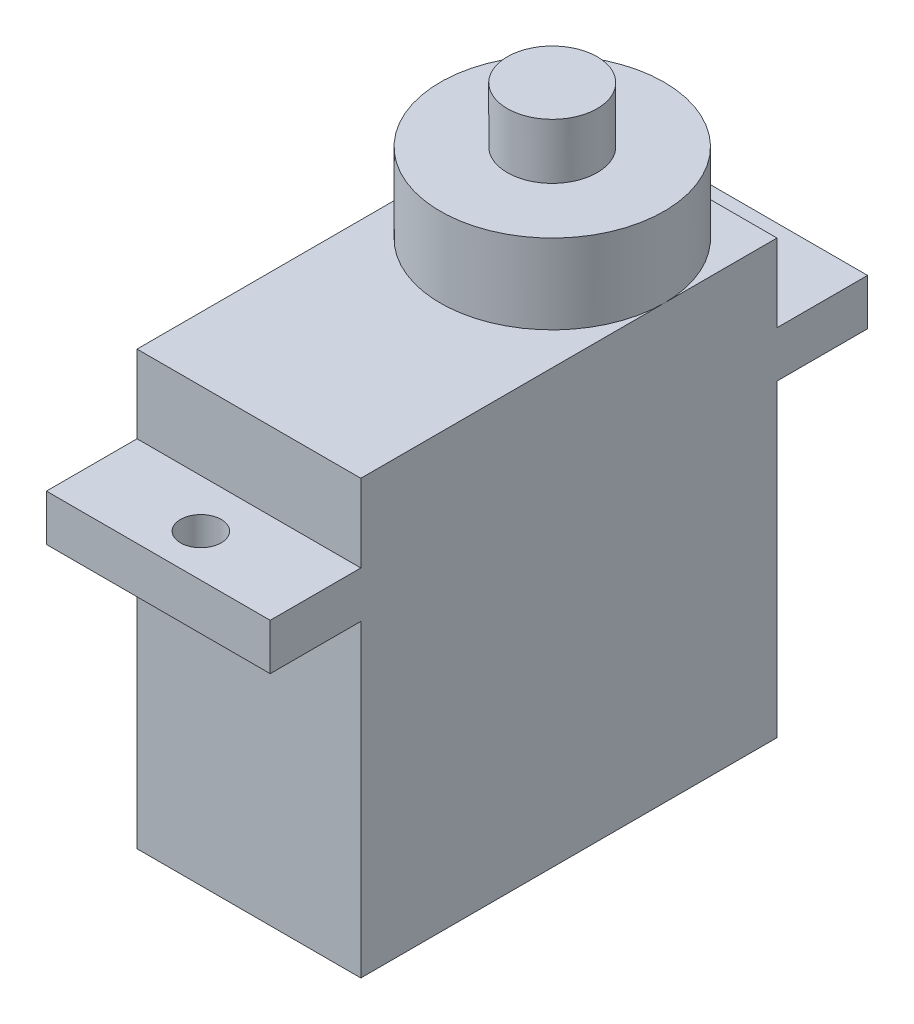
ISO-10303-21;
HEADER;
FILE_DESCRIPTION(('STEP AP214'),'2;1');
FILE_NAME('part.step','',(''),(''),'','','');
FILE_SCHEMA(('AUTOMOTIVE_DESIGN { 1 0 10303 214 1 1 1 1 }'));
ENDSEC;
DATA;
#1=APPLICATION_CONTEXT('core data for automotive mechanical design processes');
#2=APPLICATION_PROTOCOL_DEFINITION('international standard','automotive_design',2000,#1);
#3=PRODUCT_CONTEXT('',#1,'mechanical');
#4=PRODUCT('Part','Part','',(#3));
#5=PRODUCT_RELATED_PRODUCT_CATEGORY('part','',(#4));
#6=PRODUCT_DEFINITION_FORMATION('','',#4);
#7=PRODUCT_DEFINITION_CONTEXT('part definition',#1,'design');
#8=PRODUCT_DEFINITION('design','',#6,#7);
#9=PRODUCT_DEFINITION_SHAPE('','',#8);
#10=(LENGTH_UNIT() NAMED_UNIT(*) SI_UNIT(.MILLI.,.METRE.));
#11=(NAMED_UNIT(*) PLANE_ANGLE_UNIT() SI_UNIT($,.RADIAN.));
#12=(NAMED_UNIT(*) SI_UNIT($,.STERADIAN.) SOLID_ANGLE_UNIT());
#13=UNCERTAINTY_MEASURE_WITH_UNIT(LENGTH_MEASURE(1.E-05),#10,'distance_accuracy_value','');
#14=(GEOMETRIC_REPRESENTATION_CONTEXT(3) GLOBAL_UNCERTAINTY_ASSIGNED_CONTEXT((#13)) GLOBAL_UNIT_ASSIGNED_CONTEXT((#10,
#11,#12)) REPRESENTATION_CONTEXT('',''));
#15=CARTESIAN_POINT('',(0.,0.,0.));
#16=DIRECTION('',(0.,0.,1.));
#17=DIRECTION('',(1.,0.,0.));
#18=AXIS2_PLACEMENT_3D('',#15,#16,#17);
#19=CARTESIAN_POINT('',(12.1,23.4,-22.5));
#20=DIRECTION('',(0.,-1.,0.));
#21=DIRECTION('',(0.,0.,-1.));
#22=AXIS2_PLACEMENT_3D('',#19,#20,#21);
#23=PLANE('',#22);
#24=CARTESIAN_POINT('',(6.05,23.4,-16.4));
#25=DIRECTION('',(0.,1.,0.));
#26=DIRECTION('',(0.,0.,1.));
#27=AXIS2_PLACEMENT_3D('',#24,#25,#26);
#28=CIRCLE('',#27,6.05);
#29=CARTESIAN_POINT('',(12.1,23.4,-16.4));
#30=VERTEX_POINT('',#29);
#31=CARTESIAN_POINT('',(0.,23.4,-16.4));
#32=VERTEX_POINT('',#31);
#33=EDGE_CURVE('E253',#30,#32,#28,.T.);
#34=ORIENTED_EDGE('',*,*,#33,.F.);
#35=DIRECTION('',(0.,0.,1.));
#36=VECTOR('',#35,1.);
#37=CARTESIAN_POINT('',(12.1,23.4,-22.5));
#38=LINE('',#37,#36);
#39=CARTESIAN_POINT('',(12.1,23.4,-22.5));
#40=VERTEX_POINT('',#39);
#41=EDGE_CURVE('E352',#40,#30,#38,.T.);
#42=ORIENTED_EDGE('',*,*,#41,.F.);
#43=DIRECTION('',(-1.,0.,0.));
#44=VECTOR('',#43,1.);
#45=CARTESIAN_POINT('',(12.1,23.4,-22.5));
#46=LINE('',#45,#44);
#47=CARTESIAN_POINT('',(0.,23.4,-22.5));
#48=VERTEX_POINT('',#47);
#49=EDGE_CURVE('E225',#40,#48,#46,.T.);
#50=ORIENTED_EDGE('',*,*,#49,.T.);
#51=DIRECTION('',(0.,0.,1.));
#52=VECTOR('',#51,1.);
#53=CARTESIAN_POINT('',(0.,23.4,-22.5));
#54=LINE('',#53,#52);
#55=EDGE_CURVE('E200',#48,#32,#54,.T.);
#56=ORIENTED_EDGE('',*,*,#55,.T.);
#57=EDGE_LOOP('',(#34,#42,#50,#56));
#58=FACE_BOUND('',#57,.T.);
#59=ADVANCED_FACE('F39',(#58),#23,.F.);
#60=CARTESIAN_POINT('',(12.1,16.7,0.));
#61=DIRECTION('',(0.,0.,-1.));
#62=DIRECTION('',(0.,1.,0.));
#63=AXIS2_PLACEMENT_3D('',#60,#61,#62);
#64=PLANE('',#63);
#65=DIRECTION('',(0.,-1.,0.));
#66=VECTOR('',#65,1.);
#67=CARTESIAN_POINT('',(0.,16.7,0.));
#68=LINE('',#67,#66);
#69=CARTESIAN_POINT('',(0.,16.7,0.));
#70=VERTEX_POINT('',#69);
#71=CARTESIAN_POINT('',(0.,0.,0.));
#72=VERTEX_POINT('',#71);
#73=EDGE_CURVE('E176',#70,#72,#68,.T.);
#74=ORIENTED_EDGE('',*,*,#73,.T.);
#75=DIRECTION('',(-1.,0.,0.));
#76=VECTOR('',#75,1.);
#77=CARTESIAN_POINT('',(12.1,0.,0.));
#78=LINE('',#77,#76);
#79=CARTESIAN_POINT('',(12.1,0.,0.));
#80=VERTEX_POINT('',#79);
#81=EDGE_CURVE('E248',#80,#72,#78,.T.);
#82=ORIENTED_EDGE('',*,*,#81,.F.);
#83=DIRECTION('',(0.,-1.,0.));
#84=VECTOR('',#83,1.);
#85=CARTESIAN_POINT('',(12.1,16.7,0.));
#86=LINE('',#85,#84);
#87=CARTESIAN_POINT('',(12.1,16.7,0.));
#88=VERTEX_POINT('',#87);
#89=EDGE_CURVE('E214',#88,#80,#86,.T.);
#90=ORIENTED_EDGE('',*,*,#89,.F.);
#91=DIRECTION('',(-1.,0.,0.));
#92=VECTOR('',#91,1.);
#93=CARTESIAN_POINT('',(12.1,16.7,0.));
#94=LINE('',#93,#92);
#95=EDGE_CURVE('E172',#88,#70,#94,.T.);
#96=ORIENTED_EDGE('',*,*,#95,.T.);
#97=EDGE_LOOP('',(#74,#82,#90,#96));
#98=FACE_BOUND('',#97,.T.);
#99=ADVANCED_FACE('F41',(#98),#64,.F.);
#100=CARTESIAN_POINT('',(12.1,0.,0.));
#101=DIRECTION('',(0.,1.,0.));
#102=DIRECTION('',(0.,0.,1.));
#103=AXIS2_PLACEMENT_3D('',#100,#101,#102);
#104=PLANE('',#103);
#105=DIRECTION('',(0.,0.,-1.));
#106=VECTOR('',#105,1.);
#107=CARTESIAN_POINT('',(0.,0.,0.));
#108=LINE('',#107,#106);
#109=CARTESIAN_POINT('',(0.,0.,-22.5));
#110=VERTEX_POINT('',#109);
#111=EDGE_CURVE('E180',#72,#110,#108,.T.);
#112=ORIENTED_EDGE('',*,*,#111,.T.);
#113=DIRECTION('',(-1.,0.,0.));
#114=VECTOR('',#113,1.);
#115=CARTESIAN_POINT('',(12.1,0.,-22.5));
#116=LINE('',#115,#114);
#117=CARTESIAN_POINT('',(12.1,0.,-22.5));
#118=VERTEX_POINT('',#117);
#119=EDGE_CURVE('E245',#118,#110,#116,.T.);
#120=ORIENTED_EDGE('',*,*,#119,.F.);
#121=DIRECTION('',(0.,0.,-1.));
#122=VECTOR('',#121,1.);
#123=CARTESIAN_POINT('',(12.1,0.,0.));
#124=LINE('',#123,#122);
#125=EDGE_CURVE('E118',#80,#118,#124,.T.);
#126=ORIENTED_EDGE('',*,*,#125,.F.);
#127=ORIENTED_EDGE('',*,*,#81,.T.);
#128=EDGE_LOOP('',(#112,#120,#126,#127));
#129=FACE_BOUND('',#128,.T.);
#130=ADVANCED_FACE('F287',(#129),#104,.F.);
#131=CARTESIAN_POINT('',(12.1,0.,-22.5));
#132=DIRECTION('',(0.,0.,1.));
#133=DIRECTION('',(1.,0.,0.));
#134=AXIS2_PLACEMENT_3D('',#131,#132,#133);
#135=PLANE('',#134);
#136=DIRECTION('',(0.,1.,0.));
#137=VECTOR('',#136,1.);
#138=CARTESIAN_POINT('',(0.,0.,-22.5));
#139=LINE('',#138,#137);
#140=CARTESIAN_POINT('',(0.,16.7,-22.5));
#141=VERTEX_POINT('',#140);
#142=EDGE_CURVE('E184',#110,#141,#139,.T.);
#143=ORIENTED_EDGE('',*,*,#142,.T.);
#144=DIRECTION('',(-1.,0.,0.));
#145=VECTOR('',#144,1.);
#146=CARTESIAN_POINT('',(12.1,16.7,-22.5));
#147=LINE('',#146,#145);
#148=CARTESIAN_POINT('',(12.1,16.7,-22.5));
#149=VERTEX_POINT('',#148);
#150=EDGE_CURVE('E241',#149,#141,#147,.T.);
#151=ORIENTED_EDGE('',*,*,#150,.F.);
#152=DIRECTION('',(0.,1.,0.));
#153=VECTOR('',#152,1.);
#154=CARTESIAN_POINT('',(12.1,0.,-22.5));
#155=LINE('',#154,#153);
#156=EDGE_CURVE('E326',#118,#149,#155,.T.);
#157=ORIENTED_EDGE('',*,*,#156,.F.);
#158=ORIENTED_EDGE('',*,*,#119,.T.);
#159=EDGE_LOOP('',(#143,#151,#157,#158));
#160=FACE_BOUND('',#159,.T.);
#161=ADVANCED_FACE('F314',(#160),#135,.F.);
#162=CARTESIAN_POINT('',(12.1,16.7,-22.5));
#163=DIRECTION('',(0.,1.,0.));
#164=DIRECTION('',(0.,0.,1.));
#165=AXIS2_PLACEMENT_3D('',#162,#163,#164);
#166=PLANE('',#165);
#167=CARTESIAN_POINT('',(6.05,16.7,-25.1));
#168=DIRECTION('',(0.,1.,0.));
#169=DIRECTION('',(0.,0.,1.));
#170=AXIS2_PLACEMENT_3D('',#167,#168,#169);
#171=CIRCLE('',#170,1.1);
#172=CARTESIAN_POINT('',(6.05,16.7,-24.));
#173=VERTEX_POINT('',#172);
#174=EDGE_CURVE('E181',#173,#173,#171,.T.);
#175=ORIENTED_EDGE('',*,*,#174,.T.);
#176=EDGE_LOOP('',(#175));
#177=FACE_BOUND('',#176,.T.);
#178=DIRECTION('',(0.,0.,-1.));
#179=VECTOR('',#178,1.);
#180=CARTESIAN_POINT('',(0.,16.7,-22.5));
#181=LINE('',#180,#179);
#182=CARTESIAN_POINT('',(0.,16.7,-27.4));
#183=VERTEX_POINT('',#182);
#184=EDGE_CURVE('E187',#141,#183,#181,.T.);
#185=ORIENTED_EDGE('',*,*,#184,.T.);
#186=DIRECTION('',(-1.,0.,0.));
#187=VECTOR('',#186,1.);
#188=CARTESIAN_POINT('',(12.1,16.7,-27.4));
#189=LINE('',#188,#187);
#190=CARTESIAN_POINT('',(12.1,16.7,-27.4));
#191=VERTEX_POINT('',#190);
#192=EDGE_CURVE('E237',#191,#183,#189,.T.);
#193=ORIENTED_EDGE('',*,*,#192,.F.);
#194=DIRECTION('',(0.,0.,-1.));
#195=VECTOR('',#194,1.);
#196=CARTESIAN_POINT('',(12.1,16.7,-22.5));
#197=LINE('',#196,#195);
#198=EDGE_CURVE('E340',#149,#191,#197,.T.);
#199=ORIENTED_EDGE('',*,*,#198,.F.);
#200=ORIENTED_EDGE('',*,*,#150,.T.);
#201=EDGE_LOOP('',(#185,#193,#199,#200));
#202=FACE_BOUND('',#201,.T.);
#203=ADVANCED_FACE('F310',(#177,#202),#166,.F.);
#204=CARTESIAN_POINT('',(12.1,16.7,-27.4));
#205=DIRECTION('',(0.,0.,1.));
#206=DIRECTION('',(1.,0.,0.));
#207=AXIS2_PLACEMENT_3D('',#204,#205,#206);
#208=PLANE('',#207);
#209=DIRECTION('',(0.,1.,0.));
#210=VECTOR('',#209,1.);
#211=CARTESIAN_POINT('',(0.,16.7,-27.4));
#212=LINE('',#211,#210);
#213=CARTESIAN_POINT('',(0.,19.2,-27.4));
#214=VERTEX_POINT('',#213);
#215=EDGE_CURVE('E190',#183,#214,#212,.T.);
#216=ORIENTED_EDGE('',*,*,#215,.T.);
#217=DIRECTION('',(-1.,0.,0.));
#218=VECTOR('',#217,1.);
#219=CARTESIAN_POINT('',(12.1,19.2,-27.4));
#220=LINE('',#219,#218);
#221=CARTESIAN_POINT('',(12.1,19.2,-27.4));
#222=VERTEX_POINT('',#221);
#223=EDGE_CURVE('E233',#222,#214,#220,.T.);
#224=ORIENTED_EDGE('',*,*,#223,.F.);
#225=DIRECTION('',(0.,1.,0.));
#226=VECTOR('',#225,1.);
#227=CARTESIAN_POINT('',(12.1,16.7,-27.4));
#228=LINE('',#227,#226);
#229=EDGE_CURVE('E336',#191,#222,#228,.T.);
#230=ORIENTED_EDGE('',*,*,#229,.F.);
#231=ORIENTED_EDGE('',*,*,#192,.T.);
#232=EDGE_LOOP('',(#216,#224,#230,#231));
#233=FACE_BOUND('',#232,.T.);
#234=ADVANCED_FACE('F304',(#233),#208,.F.);
#235=CARTESIAN_POINT('',(12.1,19.2,-27.4));
#236=DIRECTION('',(0.,-1.,0.));
#237=DIRECTION('',(0.,0.,-1.));
#238=AXIS2_PLACEMENT_3D('',#235,#236,#237);
#239=PLANE('',#238);
#240=CARTESIAN_POINT('',(6.05,19.2,-25.1));
#241=DIRECTION('',(0.,1.,0.));
#242=DIRECTION('',(0.,0.,1.));
#243=AXIS2_PLACEMENT_3D('',#240,#241,#242);
#244=CIRCLE('',#243,1.1);
#245=CARTESIAN_POINT('',(6.05,19.2,-24.));
#246=VERTEX_POINT('',#245);
#247=EDGE_CURVE('E265',#246,#246,#244,.T.);
#248=ORIENTED_EDGE('',*,*,#247,.F.);
#249=EDGE_LOOP('',(#248));
#250=FACE_BOUND('',#249,.T.);
#251=DIRECTION('',(0.,0.,1.));
#252=VECTOR('',#251,1.);
#253=CARTESIAN_POINT('',(0.,19.2,-27.4));
#254=LINE('',#253,#252);
#255=CARTESIAN_POINT('',(0.,19.2,-22.5));
#256=VERTEX_POINT('',#255);
#257=EDGE_CURVE('E193',#214,#256,#254,.T.);
#258=ORIENTED_EDGE('',*,*,#257,.T.);
#259=DIRECTION('',(-1.,0.,0.));
#260=VECTOR('',#259,1.);
#261=CARTESIAN_POINT('',(12.1,19.2,-22.5));
#262=LINE('',#261,#260);
#263=CARTESIAN_POINT('',(12.1,19.2,-22.5));
#264=VERTEX_POINT('',#263);
#265=EDGE_CURVE('E229',#264,#256,#262,.T.);
#266=ORIENTED_EDGE('',*,*,#265,.F.);
#267=DIRECTION('',(0.,0.,1.));
#268=VECTOR('',#267,1.);
#269=CARTESIAN_POINT('',(12.1,19.2,-27.4));
#270=LINE('',#269,#268);
#271=EDGE_CURVE('E339',#222,#264,#270,.T.);
#272=ORIENTED_EDGE('',*,*,#271,.F.);
#273=ORIENTED_EDGE('',*,*,#223,.T.);
#274=EDGE_LOOP('',(#258,#266,#272,#273));
#275=FACE_BOUND('',#274,.T.);
#276=ADVANCED_FACE('F299',(#250,#275),#239,.F.);
#277=CARTESIAN_POINT('',(12.1,19.2,-22.5));
#278=DIRECTION('',(0.,0.,1.));
#279=DIRECTION('',(1.,0.,0.));
#280=AXIS2_PLACEMENT_3D('',#277,#278,#279);
#281=PLANE('',#280);
#282=DIRECTION('',(0.,1.,0.));
#283=VECTOR('',#282,1.);
#284=CARTESIAN_POINT('',(0.,19.2,-22.5));
#285=LINE('',#284,#283);
#286=EDGE_CURVE('E196',#256,#48,#285,.T.);
#287=ORIENTED_EDGE('',*,*,#286,.T.);
#288=ORIENTED_EDGE('',*,*,#49,.F.);
#289=DIRECTION('',(0.,1.,0.));
#290=VECTOR('',#289,1.);
#291=CARTESIAN_POINT('',(12.1,19.2,-22.5));
#292=LINE('',#291,#290);
#293=EDGE_CURVE('E344',#264,#40,#292,.T.);
#294=ORIENTED_EDGE('',*,*,#293,.F.);
#295=ORIENTED_EDGE('',*,*,#265,.T.);
#296=EDGE_LOOP('',(#287,#288,#294,#295));
#297=FACE_BOUND('',#296,.T.);
#298=ADVANCED_FACE('F293',(#297),#281,.F.);
#299=EDGE_CURVE('E49',#32,#30,#28,.T.);
#300=ORIENTED_EDGE('',*,*,#299,.F.);
#301=CARTESIAN_POINT('',(0.,23.4,0.));
#302=VERTEX_POINT('',#301);
#303=EDGE_CURVE('E199',#32,#302,#54,.T.);
#304=ORIENTED_EDGE('',*,*,#303,.T.);
#305=DIRECTION('',(-1.,0.,0.));
#306=VECTOR('',#305,1.);
#307=CARTESIAN_POINT('',(12.1,23.4,0.));
#308=LINE('',#307,#306);
#309=CARTESIAN_POINT('',(12.1,23.4,0.));
#310=VERTEX_POINT('',#309);
#311=EDGE_CURVE('E221',#310,#302,#308,.T.);
#312=ORIENTED_EDGE('',*,*,#311,.F.);
#313=EDGE_CURVE('E351',#30,#310,#38,.T.);
#314=ORIENTED_EDGE('',*,*,#313,.F.);
#315=EDGE_LOOP('',(#300,#304,#312,#314));
#316=FACE_BOUND('',#315,.T.);
#317=ADVANCED_FACE('F283',(#316),#23,.F.);
#318=CARTESIAN_POINT('',(12.1,23.4,0.));
#319=DIRECTION('',(0.,0.,-1.));
#320=DIRECTION('',(0.,1.,0.));
#321=AXIS2_PLACEMENT_3D('',#318,#319,#320);
#322=PLANE('',#321);
#323=DIRECTION('',(0.,-1.,0.));
#324=VECTOR('',#323,1.);
#325=CARTESIAN_POINT('',(0.,23.4,0.));
#326=LINE('',#325,#324);
#327=CARTESIAN_POINT('',(0.,19.2,0.));
#328=VERTEX_POINT('',#327);
#329=EDGE_CURVE('E204',#302,#328,#326,.T.);
#330=ORIENTED_EDGE('',*,*,#329,.T.);
#331=DIRECTION('',(-1.,0.,0.));
#332=VECTOR('',#331,1.);
#333=CARTESIAN_POINT('',(12.1,19.2,0.));
#334=LINE('',#333,#332);
#335=CARTESIAN_POINT('',(12.1,19.2,0.));
#336=VERTEX_POINT('',#335);
#337=EDGE_CURVE('E165',#336,#328,#334,.T.);
#338=ORIENTED_EDGE('',*,*,#337,.F.);
#339=DIRECTION('',(0.,-1.,0.));
#340=VECTOR('',#339,1.);
#341=CARTESIAN_POINT('',(12.1,23.4,0.));
#342=LINE('',#341,#340);
#343=EDGE_CURVE('E151',#310,#336,#342,.T.);
#344=ORIENTED_EDGE('',*,*,#343,.F.);
#345=ORIENTED_EDGE('',*,*,#311,.T.);
#346=EDGE_LOOP('',(#330,#338,#344,#345));
#347=FACE_BOUND('',#346,.T.);
#348=ADVANCED_FACE('F292',(#347),#322,.F.);
#349=CARTESIAN_POINT('',(12.1,19.2,0.));
#350=DIRECTION('',(0.,-1.,0.));
#351=DIRECTION('',(0.,0.,-1.));
#352=AXIS2_PLACEMENT_3D('',#349,#350,#351);
#353=PLANE('',#352);
#354=CARTESIAN_POINT('',(6.05,19.2,2.6));
#355=DIRECTION('',(0.,1.,0.));
#356=DIRECTION('',(0.,0.,1.));
#357=AXIS2_PLACEMENT_3D('',#354,#355,#356);
#358=CIRCLE('',#357,1.1);
#359=CARTESIAN_POINT('',(6.05,19.2,3.7));
#360=VERTEX_POINT('',#359);
#361=EDGE_CURVE('E374',#360,#360,#358,.T.);
#362=ORIENTED_EDGE('',*,*,#361,.F.);
#363=EDGE_LOOP('',(#362));
#364=FACE_BOUND('',#363,.T.);
#365=DIRECTION('',(0.,0.,1.));
#366=VECTOR('',#365,1.);
#367=CARTESIAN_POINT('',(0.,19.2,0.));
#368=LINE('',#367,#366);
#369=CARTESIAN_POINT('',(0.,19.2,4.9));
#370=VERTEX_POINT('',#369);
#371=EDGE_CURVE('E161',#328,#370,#368,.T.);
#372=ORIENTED_EDGE('',*,*,#371,.T.);
#373=DIRECTION('',(-1.,0.,0.));
#374=VECTOR('',#373,1.);
#375=CARTESIAN_POINT('',(12.1,19.2,4.9));
#376=LINE('',#375,#374);
#377=CARTESIAN_POINT('',(12.1,19.2,4.9));
#378=VERTEX_POINT('',#377);
#379=EDGE_CURVE('E158',#378,#370,#376,.T.);
#380=ORIENTED_EDGE('',*,*,#379,.F.);
#381=DIRECTION('',(0.,0.,1.));
#382=VECTOR('',#381,1.);
#383=CARTESIAN_POINT('',(12.1,19.2,0.));
#384=LINE('',#383,#382);
#385=EDGE_CURVE('E144',#336,#378,#384,.T.);
#386=ORIENTED_EDGE('',*,*,#385,.F.);
#387=ORIENTED_EDGE('',*,*,#337,.T.);
#388=EDGE_LOOP('',(#372,#380,#386,#387));
#389=FACE_BOUND('',#388,.T.);
#390=ADVANCED_FACE('F159',(#364,#389),#353,.F.);
#391=CARTESIAN_POINT('',(12.1,19.2,4.9));
#392=DIRECTION('',(0.,0.,-1.));
#393=DIRECTION('',(0.,1.,0.));
#394=AXIS2_PLACEMENT_3D('',#391,#392,#393);
#395=PLANE('',#394);
#396=DIRECTION('',(0.,-1.,0.));
#397=VECTOR('',#396,1.);
#398=CARTESIAN_POINT('',(0.,19.2,4.9));
#399=LINE('',#398,#397);
#400=CARTESIAN_POINT('',(0.,16.7,4.9));
#401=VERTEX_POINT('',#400);
#402=EDGE_CURVE('E209',#370,#401,#399,.T.);
#403=ORIENTED_EDGE('',*,*,#402,.T.);
#404=DIRECTION('',(-1.,0.,0.));
#405=VECTOR('',#404,1.);
#406=CARTESIAN_POINT('',(12.1,16.7,4.9));
#407=LINE('',#406,#405);
#408=CARTESIAN_POINT('',(12.1,16.7,4.9));
#409=VERTEX_POINT('',#408);
#410=EDGE_CURVE('E166',#409,#401,#407,.T.);
#411=ORIENTED_EDGE('',*,*,#410,.F.);
#412=DIRECTION('',(0.,-1.,0.));
#413=VECTOR('',#412,1.);
#414=CARTESIAN_POINT('',(12.1,19.2,4.9));
#415=LINE('',#414,#413);
#416=EDGE_CURVE('E148',#378,#409,#415,.T.);
#417=ORIENTED_EDGE('',*,*,#416,.F.);
#418=ORIENTED_EDGE('',*,*,#379,.T.);
#419=EDGE_LOOP('',(#403,#411,#417,#418));
#420=FACE_BOUND('',#419,.T.);
#421=ADVANCED_FACE('F168',(#420),#395,.F.);
#422=CARTESIAN_POINT('',(12.1,16.7,4.9));
#423=DIRECTION('',(0.,1.,0.));
#424=DIRECTION('',(0.,0.,1.));
#425=AXIS2_PLACEMENT_3D('',#422,#423,#424);
#426=PLANE('',#425);
#427=CARTESIAN_POINT('',(6.05,16.7,2.6));
#428=DIRECTION('',(0.,1.,0.));
#429=DIRECTION('',(0.,0.,1.));
#430=AXIS2_PLACEMENT_3D('',#427,#428,#429);
#431=CIRCLE('',#430,1.1);
#432=CARTESIAN_POINT('',(6.05,16.7,3.7));
#433=VERTEX_POINT('',#432);
#434=EDGE_CURVE('E43',#433,#433,#431,.T.);
#435=ORIENTED_EDGE('',*,*,#434,.T.);
#436=EDGE_LOOP('',(#435));
#437=FACE_BOUND('',#436,.T.);
#438=DIRECTION('',(0.,0.,-1.));
#439=VECTOR('',#438,1.);
#440=CARTESIAN_POINT('',(0.,16.7,4.9));
#441=LINE('',#440,#439);
#442=EDGE_CURVE('E109',#401,#70,#441,.T.);
#443=ORIENTED_EDGE('',*,*,#442,.T.);
#444=ORIENTED_EDGE('',*,*,#95,.F.);
#445=DIRECTION('',(0.,0.,-1.));
#446=VECTOR('',#445,1.);
#447=CARTESIAN_POINT('',(12.1,16.7,4.9));
#448=LINE('',#447,#446);
#449=EDGE_CURVE('E65',#409,#88,#448,.T.);
#450=ORIENTED_EDGE('',*,*,#449,.F.);
#451=ORIENTED_EDGE('',*,*,#410,.T.);
#452=EDGE_LOOP('',(#443,#444,#450,#451));
#453=FACE_BOUND('',#452,.T.);
#454=ADVANCED_FACE('F360',(#437,#453),#426,.F.);
#455=CARTESIAN_POINT('',(12.1,0.,0.));
#456=DIRECTION('',(1.,0.,0.));
#457=DIRECTION('',(0.,0.,-1.));
#458=AXIS2_PLACEMENT_3D('',#455,#456,#457);
#459=PLANE('',#458);
#460=ORIENTED_EDGE('',*,*,#89,.T.);
#461=ORIENTED_EDGE('',*,*,#125,.T.);
#462=ORIENTED_EDGE('',*,*,#156,.T.);
#463=ORIENTED_EDGE('',*,*,#198,.T.);
#464=ORIENTED_EDGE('',*,*,#229,.T.);
#465=ORIENTED_EDGE('',*,*,#271,.T.);
#466=ORIENTED_EDGE('',*,*,#293,.T.);
#467=ORIENTED_EDGE('',*,*,#41,.T.);
#468=ORIENTED_EDGE('',*,*,#313,.T.);
#469=ORIENTED_EDGE('',*,*,#343,.T.);
#470=ORIENTED_EDGE('',*,*,#385,.T.);
#471=ORIENTED_EDGE('',*,*,#416,.T.);
#472=ORIENTED_EDGE('',*,*,#449,.T.);
#473=EDGE_LOOP('',(#460,#461,#462,#463,#464,#465,#466,#467,#468,#469,#470,#471,#472));
#474=FACE_BOUND('',#473,.T.);
#475=ADVANCED_FACE('F146',(#474),#459,.T.);
#476=CARTESIAN_POINT('',(0.,0.,0.));
#477=DIRECTION('',(1.,0.,0.));
#478=DIRECTION('',(0.,0.,-1.));
#479=AXIS2_PLACEMENT_3D('',#476,#477,#478);
#480=PLANE('',#479);
#481=ORIENTED_EDGE('',*,*,#73,.F.);
#482=ORIENTED_EDGE('',*,*,#442,.F.);
#483=ORIENTED_EDGE('',*,*,#402,.F.);
#484=ORIENTED_EDGE('',*,*,#371,.F.);
#485=ORIENTED_EDGE('',*,*,#329,.F.);
#486=ORIENTED_EDGE('',*,*,#303,.F.);
#487=ORIENTED_EDGE('',*,*,#55,.F.);
#488=ORIENTED_EDGE('',*,*,#286,.F.);
#489=ORIENTED_EDGE('',*,*,#257,.F.);
#490=ORIENTED_EDGE('',*,*,#215,.F.);
#491=ORIENTED_EDGE('',*,*,#184,.F.);
#492=ORIENTED_EDGE('',*,*,#142,.F.);
#493=ORIENTED_EDGE('',*,*,#111,.F.);
#494=EDGE_LOOP('',(#481,#482,#483,#484,#485,#486,#487,#488,#489,#490,#491,#492,#493));
#495=FACE_BOUND('',#494,.T.);
#496=ADVANCED_FACE('F328',(#495),#480,.F.);
#497=CARTESIAN_POINT('',(6.05,0.,2.6));
#498=DIRECTION('',(0.,1.,0.));
#499=DIRECTION('',(0.,0.,1.));
#500=AXIS2_PLACEMENT_3D('',#497,#498,#499);
#501=CYLINDRICAL_SURFACE('',#500,1.1);
#502=ORIENTED_EDGE('',*,*,#361,.T.);
#503=EDGE_LOOP('',(#502));
#504=FACE_BOUND('',#503,.T.);
#505=ORIENTED_EDGE('',*,*,#434,.F.);
#506=EDGE_LOOP('',(#505));
#507=FACE_BOUND('',#506,.T.);
#508=ADVANCED_FACE('F384',(#504,#507),#501,.F.);
#509=CARTESIAN_POINT('',(6.05,0.,-25.1));
#510=DIRECTION('',(0.,1.,0.));
#511=DIRECTION('',(0.,0.,1.));
#512=AXIS2_PLACEMENT_3D('',#509,#510,#511);
#513=CYLINDRICAL_SURFACE('',#512,1.1);
#514=ORIENTED_EDGE('',*,*,#247,.T.);
#515=EDGE_LOOP('',(#514));
#516=FACE_BOUND('',#515,.T.);
#517=ORIENTED_EDGE('',*,*,#174,.F.);
#518=EDGE_LOOP('',(#517));
#519=FACE_BOUND('',#518,.T.);
#520=ADVANCED_FACE('F386',(#516,#519),#513,.F.);
#521=CARTESIAN_POINT('',(6.05,44.8119841047144,-16.4));
#522=DIRECTION('',(0.,-1.,0.));
#523=DIRECTION('',(0.,0.,-1.));
#524=AXIS2_PLACEMENT_3D('',#521,#522,#523);
#525=CYLINDRICAL_SURFACE('',#524,6.05);
#526=CARTESIAN_POINT('',(6.05,27.7,-16.4));
#527=DIRECTION('',(0.,-1.,0.));
#528=DIRECTION('',(0.,0.,-1.));
#529=AXIS2_PLACEMENT_3D('',#526,#527,#528);
#530=CIRCLE('',#529,6.05);
#531=CARTESIAN_POINT('',(6.05,27.7,-22.45));
#532=VERTEX_POINT('',#531);
#533=EDGE_CURVE('E259',#532,#532,#530,.T.);
#534=ORIENTED_EDGE('',*,*,#533,.T.);
#535=EDGE_LOOP('',(#534));
#536=FACE_BOUND('',#535,.T.);
#537=ORIENTED_EDGE('',*,*,#33,.T.);
#538=ORIENTED_EDGE('',*,*,#299,.T.);
#539=EDGE_LOOP('',(#537,#538));
#540=FACE_BOUND('',#539,.T.);
#541=ADVANCED_FACE('F392',(#536,#540),#525,.T.);
#542=CARTESIAN_POINT('',(0.,27.7,0.));
#543=DIRECTION('',(0.,-1.,0.));
#544=DIRECTION('',(0.,0.,-1.));
#545=AXIS2_PLACEMENT_3D('',#542,#543,#544);
#546=PLANE('',#545);
#547=CARTESIAN_POINT('',(6.05,27.7,-16.4));
#548=DIRECTION('',(0.,1.,0.));
#549=DIRECTION('',(0.,0.,1.));
#550=AXIS2_PLACEMENT_3D('',#547,#548,#549);
#551=CIRCLE('',#550,2.43);
#552=CARTESIAN_POINT('',(6.05,27.7,-13.97));
#553=VERTEX_POINT('',#552);
#554=EDGE_CURVE('E11',#553,#553,#551,.T.);
#555=ORIENTED_EDGE('',*,*,#554,.F.);
#556=EDGE_LOOP('',(#555));
#557=FACE_BOUND('',#556,.T.);
#558=ORIENTED_EDGE('',*,*,#533,.F.);
#559=EDGE_LOOP('',(#558));
#560=FACE_BOUND('',#559,.T.);
#561=ADVANCED_FACE('F278',(#557,#560),#546,.F.);
#562=CARTESIAN_POINT('',(6.05,37.5730779131332,-16.4));
#563=DIRECTION('',(0.,-1.,0.));
#564=DIRECTION('',(0.,0.,-1.));
#565=AXIS2_PLACEMENT_3D('',#562,#563,#564);
#566=CYLINDRICAL_SURFACE('',#565,2.43);
#567=CARTESIAN_POINT('',(6.05,30.7,-16.4));
#568=DIRECTION('',(0.,-1.,0.));
#569=DIRECTION('',(0.,0.,-1.));
#570=AXIS2_PLACEMENT_3D('',#567,#568,#569);
#571=CIRCLE('',#570,2.43);
#572=CARTESIAN_POINT('',(6.05,30.7,-18.83));
#573=VERTEX_POINT('',#572);
#574=EDGE_CURVE('E260',#573,#573,#571,.T.);
#575=ORIENTED_EDGE('',*,*,#574,.T.);
#576=EDGE_LOOP('',(#575));
#577=FACE_BOUND('',#576,.T.);
#578=ORIENTED_EDGE('',*,*,#554,.T.);
#579=EDGE_LOOP('',(#578));
#580=FACE_BOUND('',#579,.T.);
#581=ADVANCED_FACE('F269',(#577,#580),#566,.T.);
#582=CARTESIAN_POINT('',(0.,30.7,0.));
#583=DIRECTION('',(0.,-1.,0.));
#584=DIRECTION('',(0.,0.,-1.));
#585=AXIS2_PLACEMENT_3D('',#582,#583,#584);
#586=PLANE('',#585);
#587=ORIENTED_EDGE('',*,*,#574,.F.);
#588=EDGE_LOOP('',(#587));
#589=FACE_BOUND('',#588,.T.);
#590=ADVANCED_FACE('F272',(#589),#586,.F.);
#591=CLOSED_SHELL('',(#59,#99,#130,#161,#203,#234,#276,#298,#317,#348,#390,#421,#454,#475,#496,
#508,#520,#541,#561,#581,#590));
#592=MANIFOLD_SOLID_BREP('B2',#591);
#593=ADVANCED_BREP_SHAPE_REPRESENTATION('',(#18,#592),#14);
#594=SHAPE_DEFINITION_REPRESENTATION(#9,#593);
ENDSEC;
END-ISO-10303-21;
